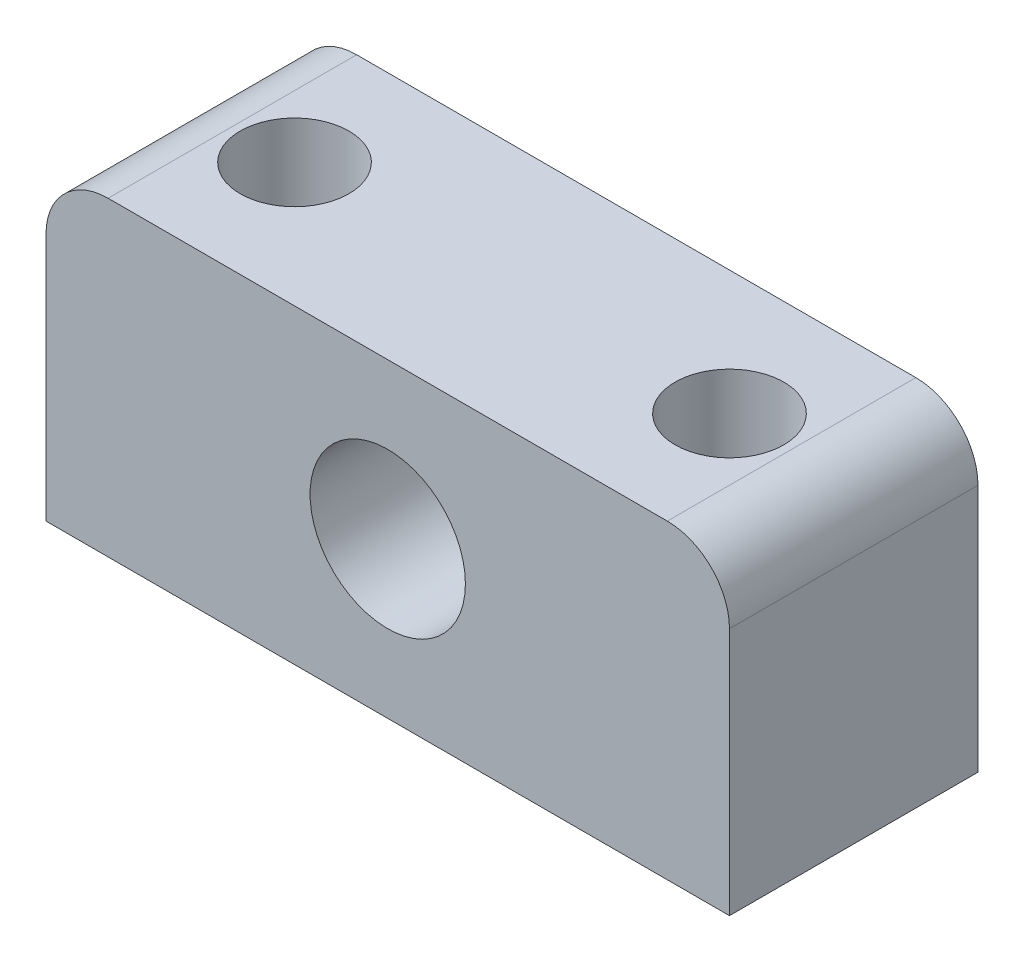
ISO-10303-21;
HEADER;
FILE_DESCRIPTION(('STEP AP214'),'2;1');
FILE_NAME('part.step','',(''),(''),'','','');
FILE_SCHEMA(('AUTOMOTIVE_DESIGN { 1 0 10303 214 1 1 1 1 }'));
ENDSEC;
DATA;
#1=APPLICATION_CONTEXT('core data for automotive mechanical design processes');
#2=APPLICATION_PROTOCOL_DEFINITION('international standard','automotive_design',2000,#1);
#3=PRODUCT_CONTEXT('',#1,'mechanical');
#4=PRODUCT('Part','Part','',(#3));
#5=PRODUCT_RELATED_PRODUCT_CATEGORY('part','',(#4));
#6=PRODUCT_DEFINITION_FORMATION('','',#4);
#7=PRODUCT_DEFINITION_CONTEXT('part definition',#1,'design');
#8=PRODUCT_DEFINITION('design','',#6,#7);
#9=PRODUCT_DEFINITION_SHAPE('','',#8);
#10=(LENGTH_UNIT() NAMED_UNIT(*) SI_UNIT(.MILLI.,.METRE.));
#11=(NAMED_UNIT(*) PLANE_ANGLE_UNIT() SI_UNIT($,.RADIAN.));
#12=(NAMED_UNIT(*) SI_UNIT($,.STERADIAN.) SOLID_ANGLE_UNIT());
#13=UNCERTAINTY_MEASURE_WITH_UNIT(LENGTH_MEASURE(1.E-05),#10,'distance_accuracy_value','');
#14=(GEOMETRIC_REPRESENTATION_CONTEXT(3) GLOBAL_UNCERTAINTY_ASSIGNED_CONTEXT((#13)) GLOBAL_UNIT_ASSIGNED_CONTEXT((#10,
#11,#12)) REPRESENTATION_CONTEXT('',''));
#15=CARTESIAN_POINT('',(0.,0.,0.));
#16=DIRECTION('',(0.,0.,1.));
#17=DIRECTION('',(1.,0.,0.));
#18=AXIS2_PLACEMENT_3D('',#15,#16,#17);
#19=CARTESIAN_POINT('',(0.,0.,4.));
#20=DIRECTION('',(0.,0.,1.));
#21=DIRECTION('',(1.,0.,0.));
#22=AXIS2_PLACEMENT_3D('',#19,#20,#21);
#23=PLANE('',#22);
#24=DIRECTION('',(0.,1.,0.));
#25=VECTOR('',#24,1.);
#26=CARTESIAN_POINT('',(11.,5.,4.));
#27=LINE('',#26,#25);
#28=CARTESIAN_POINT('',(11.,-5.,4.));
#29=VERTEX_POINT('',#28);
#30=CARTESIAN_POINT('',(11.,3.,4.));
#31=VERTEX_POINT('',#30);
#32=EDGE_CURVE('E120',#29,#31,#27,.T.);
#33=ORIENTED_EDGE('',*,*,#32,.T.);
#34=CARTESIAN_POINT('',(9.,3.,4.));
#35=DIRECTION('',(0.,0.,1.));
#36=DIRECTION('',(1.,0.,0.));
#37=AXIS2_PLACEMENT_3D('',#34,#35,#36);
#38=CIRCLE('',#37,2.);
#39=CARTESIAN_POINT('',(9.,5.,4.));
#40=VERTEX_POINT('',#39);
#41=EDGE_CURVE('E41',#31,#40,#38,.T.);
#42=ORIENTED_EDGE('',*,*,#41,.T.);
#43=DIRECTION('',(-1.,0.,0.));
#44=VECTOR('',#43,1.);
#45=CARTESIAN_POINT('',(-11.,5.,4.));
#46=LINE('',#45,#44);
#47=CARTESIAN_POINT('',(-9.,5.,4.));
#48=VERTEX_POINT('',#47);
#49=EDGE_CURVE('E94',#40,#48,#46,.T.);
#50=ORIENTED_EDGE('',*,*,#49,.T.);
#51=CARTESIAN_POINT('',(-9.,3.,4.));
#52=DIRECTION('',(0.,0.,1.));
#53=DIRECTION('',(1.,0.,0.));
#54=AXIS2_PLACEMENT_3D('',#51,#52,#53);
#55=CIRCLE('',#54,2.);
#56=CARTESIAN_POINT('',(-11.,3.,4.));
#57=VERTEX_POINT('',#56);
#58=EDGE_CURVE('E48',#48,#57,#55,.T.);
#59=ORIENTED_EDGE('',*,*,#58,.T.);
#60=DIRECTION('',(0.,-1.,0.));
#61=VECTOR('',#60,1.);
#62=CARTESIAN_POINT('',(-11.,5.,4.));
#63=LINE('',#62,#61);
#64=CARTESIAN_POINT('',(-11.,-5.,4.));
#65=VERTEX_POINT('',#64);
#66=EDGE_CURVE('E86',#57,#65,#63,.T.);
#67=ORIENTED_EDGE('',*,*,#66,.T.);
#68=DIRECTION('',(1.,0.,0.));
#69=VECTOR('',#68,1.);
#70=CARTESIAN_POINT('',(-11.,-5.,4.));
#71=LINE('',#70,#69);
#72=EDGE_CURVE('E90',#65,#29,#71,.T.);
#73=ORIENTED_EDGE('',*,*,#72,.T.);
#74=EDGE_LOOP('',(#33,#42,#50,#59,#67,#73));
#75=FACE_BOUND('',#74,.T.);
#76=CARTESIAN_POINT('',(0.,0.,4.));
#77=DIRECTION('',(0.,0.,1.));
#78=DIRECTION('',(1.,0.,0.));
#79=AXIS2_PLACEMENT_3D('',#76,#77,#78);
#80=CIRCLE('',#79,2.5);
#81=CARTESIAN_POINT('',(2.5,0.,4.));
#82=VERTEX_POINT('',#81);
#83=EDGE_CURVE('E115',#82,#82,#80,.T.);
#84=ORIENTED_EDGE('',*,*,#83,.F.);
#85=EDGE_LOOP('',(#84));
#86=FACE_BOUND('',#85,.T.);
#87=ADVANCED_FACE('F33',(#75,#86),#23,.T.);
#88=CARTESIAN_POINT('',(0.,0.,-4.));
#89=DIRECTION('',(0.,0.,1.));
#90=DIRECTION('',(1.,0.,0.));
#91=AXIS2_PLACEMENT_3D('',#88,#89,#90);
#92=PLANE('',#91);
#93=DIRECTION('',(-1.,0.,0.));
#94=VECTOR('',#93,1.);
#95=CARTESIAN_POINT('',(-11.,5.,-4.));
#96=LINE('',#95,#94);
#97=CARTESIAN_POINT('',(9.,5.,-4.));
#98=VERTEX_POINT('',#97);
#99=CARTESIAN_POINT('',(-9.,5.,-4.));
#100=VERTEX_POINT('',#99);
#101=EDGE_CURVE('E114',#98,#100,#96,.T.);
#102=ORIENTED_EDGE('',*,*,#101,.F.);
#103=CARTESIAN_POINT('',(9.,3.,-4.));
#104=DIRECTION('',(0.,0.,1.));
#105=DIRECTION('',(1.,0.,0.));
#106=AXIS2_PLACEMENT_3D('',#103,#104,#105);
#107=CIRCLE('',#106,2.);
#108=CARTESIAN_POINT('',(11.,3.,-4.));
#109=VERTEX_POINT('',#108);
#110=EDGE_CURVE('E128',#98,#109,#107,.F.);
#111=ORIENTED_EDGE('',*,*,#110,.T.);
#112=DIRECTION('',(0.,1.,0.));
#113=VECTOR('',#112,1.);
#114=CARTESIAN_POINT('',(11.,5.,-4.));
#115=LINE('',#114,#113);
#116=CARTESIAN_POINT('',(11.,-5.,-4.));
#117=VERTEX_POINT('',#116);
#118=EDGE_CURVE('E112',#117,#109,#115,.T.);
#119=ORIENTED_EDGE('',*,*,#118,.F.);
#120=DIRECTION('',(1.,0.,0.));
#121=VECTOR('',#120,1.);
#122=CARTESIAN_POINT('',(-11.,-5.,-4.));
#123=LINE('',#122,#121);
#124=CARTESIAN_POINT('',(-11.,-5.,-4.));
#125=VERTEX_POINT('',#124);
#126=EDGE_CURVE('E119',#125,#117,#123,.T.);
#127=ORIENTED_EDGE('',*,*,#126,.F.);
#128=DIRECTION('',(0.,-1.,0.));
#129=VECTOR('',#128,1.);
#130=CARTESIAN_POINT('',(-11.,5.,-4.));
#131=LINE('',#130,#129);
#132=CARTESIAN_POINT('',(-11.,3.,-4.));
#133=VERTEX_POINT('',#132);
#134=EDGE_CURVE('E100',#133,#125,#131,.T.);
#135=ORIENTED_EDGE('',*,*,#134,.F.);
#136=CARTESIAN_POINT('',(-9.,3.,-4.));
#137=DIRECTION('',(0.,0.,1.));
#138=DIRECTION('',(1.,0.,0.));
#139=AXIS2_PLACEMENT_3D('',#136,#137,#138);
#140=CIRCLE('',#139,2.);
#141=EDGE_CURVE('E126',#133,#100,#140,.F.);
#142=ORIENTED_EDGE('',*,*,#141,.T.);
#143=EDGE_LOOP('',(#102,#111,#119,#127,#135,#142));
#144=FACE_BOUND('',#143,.T.);
#145=CARTESIAN_POINT('',(0.,0.,-4.));
#146=DIRECTION('',(0.,0.,1.));
#147=DIRECTION('',(1.,0.,0.));
#148=AXIS2_PLACEMENT_3D('',#145,#146,#147);
#149=CIRCLE('',#148,2.5);
#150=CARTESIAN_POINT('',(2.5,0.,-4.));
#151=VERTEX_POINT('',#150);
#152=EDGE_CURVE('E147',#151,#151,#149,.T.);
#153=ORIENTED_EDGE('',*,*,#152,.T.);
#154=EDGE_LOOP('',(#153));
#155=FACE_BOUND('',#154,.T.);
#156=ADVANCED_FACE('F142',(#144,#155),#92,.F.);
#157=CARTESIAN_POINT('',(11.,5.,4.));
#158=DIRECTION('',(-1.,0.,0.));
#159=DIRECTION('',(0.,0.,1.));
#160=AXIS2_PLACEMENT_3D('',#157,#158,#159);
#161=PLANE('',#160);
#162=ORIENTED_EDGE('',*,*,#118,.T.);
#163=DIRECTION('',(0.,0.,-1.));
#164=VECTOR('',#163,1.);
#165=CARTESIAN_POINT('',(11.,3.,4.));
#166=LINE('',#165,#164);
#167=EDGE_CURVE('E56',#109,#31,#166,.F.);
#168=ORIENTED_EDGE('',*,*,#167,.T.);
#169=ORIENTED_EDGE('',*,*,#32,.F.);
#170=DIRECTION('',(0.,0.,-1.));
#171=VECTOR('',#170,1.);
#172=CARTESIAN_POINT('',(11.,-5.,4.));
#173=LINE('',#172,#171);
#174=EDGE_CURVE('E104',#29,#117,#173,.T.);
#175=ORIENTED_EDGE('',*,*,#174,.T.);
#176=EDGE_LOOP('',(#162,#168,#169,#175));
#177=FACE_BOUND('',#176,.T.);
#178=ADVANCED_FACE('F144',(#177),#161,.F.);
#179=CARTESIAN_POINT('',(-11.,5.,4.));
#180=DIRECTION('',(0.,-1.,0.));
#181=DIRECTION('',(0.,0.,-1.));
#182=AXIS2_PLACEMENT_3D('',#179,#180,#181);
#183=PLANE('',#182);
#184=CARTESIAN_POINT('',(7.,5.,0.));
#185=DIRECTION('',(0.,1.,0.));
#186=DIRECTION('',(0.,0.,1.));
#187=AXIS2_PLACEMENT_3D('',#184,#185,#186);
#188=CIRCLE('',#187,1.75);
#189=CARTESIAN_POINT('',(7.,5.,1.75));
#190=VERTEX_POINT('',#189);
#191=EDGE_CURVE('E159',#190,#190,#188,.T.);
#192=ORIENTED_EDGE('',*,*,#191,.F.);
#193=EDGE_LOOP('',(#192));
#194=FACE_BOUND('',#193,.T.);
#195=CARTESIAN_POINT('',(-7.,5.,0.));
#196=DIRECTION('',(0.,1.,0.));
#197=DIRECTION('',(0.,0.,-1.));
#198=AXIS2_PLACEMENT_3D('',#195,#196,#197);
#199=CIRCLE('',#198,1.75);
#200=CARTESIAN_POINT('',(-7.,5.,-1.75));
#201=VERTEX_POINT('',#200);
#202=EDGE_CURVE('E153',#201,#201,#199,.T.);
#203=ORIENTED_EDGE('',*,*,#202,.F.);
#204=EDGE_LOOP('',(#203));
#205=FACE_BOUND('',#204,.T.);
#206=ORIENTED_EDGE('',*,*,#49,.F.);
#207=DIRECTION('',(0.,0.,-1.));
#208=VECTOR('',#207,1.);
#209=CARTESIAN_POINT('',(9.,5.,4.));
#210=LINE('',#209,#208);
#211=EDGE_CURVE('E123',#40,#98,#210,.T.);
#212=ORIENTED_EDGE('',*,*,#211,.T.);
#213=ORIENTED_EDGE('',*,*,#101,.T.);
#214=DIRECTION('',(0.,0.,-1.));
#215=VECTOR('',#214,1.);
#216=CARTESIAN_POINT('',(-9.,5.,4.));
#217=LINE('',#216,#215);
#218=EDGE_CURVE('E103',#100,#48,#217,.F.);
#219=ORIENTED_EDGE('',*,*,#218,.T.);
#220=EDGE_LOOP('',(#206,#212,#213,#219));
#221=FACE_BOUND('',#220,.T.);
#222=ADVANCED_FACE('F136',(#194,#205,#221),#183,.F.);
#223=CARTESIAN_POINT('',(-11.,5.,4.));
#224=DIRECTION('',(1.,0.,0.));
#225=DIRECTION('',(0.,0.,-1.));
#226=AXIS2_PLACEMENT_3D('',#223,#224,#225);
#227=PLANE('',#226);
#228=ORIENTED_EDGE('',*,*,#66,.F.);
#229=DIRECTION('',(0.,0.,-1.));
#230=VECTOR('',#229,1.);
#231=CARTESIAN_POINT('',(-11.,3.,4.));
#232=LINE('',#231,#230);
#233=EDGE_CURVE('E11',#57,#133,#232,.T.);
#234=ORIENTED_EDGE('',*,*,#233,.T.);
#235=ORIENTED_EDGE('',*,*,#134,.T.);
#236=DIRECTION('',(0.,0.,-1.));
#237=VECTOR('',#236,1.);
#238=CARTESIAN_POINT('',(-11.,-5.,4.));
#239=LINE('',#238,#237);
#240=EDGE_CURVE('E97',#65,#125,#239,.T.);
#241=ORIENTED_EDGE('',*,*,#240,.F.);
#242=EDGE_LOOP('',(#228,#234,#235,#241));
#243=FACE_BOUND('',#242,.T.);
#244=ADVANCED_FACE('F98',(#243),#227,.F.);
#245=CARTESIAN_POINT('',(-11.,-5.,4.));
#246=DIRECTION('',(0.,1.,0.));
#247=DIRECTION('',(0.,0.,1.));
#248=AXIS2_PLACEMENT_3D('',#245,#246,#247);
#249=PLANE('',#248);
#250=CARTESIAN_POINT('',(7.,-5.,0.));
#251=DIRECTION('',(0.,1.,0.));
#252=DIRECTION('',(0.,0.,1.));
#253=AXIS2_PLACEMENT_3D('',#250,#251,#252);
#254=CIRCLE('',#253,1.75);
#255=CARTESIAN_POINT('',(7.,-5.,1.75));
#256=VERTEX_POINT('',#255);
#257=EDGE_CURVE('E150',#256,#256,#254,.T.);
#258=ORIENTED_EDGE('',*,*,#257,.T.);
#259=EDGE_LOOP('',(#258));
#260=FACE_BOUND('',#259,.T.);
#261=CARTESIAN_POINT('',(-7.,-5.,0.));
#262=DIRECTION('',(0.,1.,0.));
#263=DIRECTION('',(0.,0.,-1.));
#264=AXIS2_PLACEMENT_3D('',#261,#262,#263);
#265=CIRCLE('',#264,1.75);
#266=CARTESIAN_POINT('',(-7.,-5.,-1.75));
#267=VERTEX_POINT('',#266);
#268=EDGE_CURVE('E156',#267,#267,#265,.T.);
#269=ORIENTED_EDGE('',*,*,#268,.T.);
#270=EDGE_LOOP('',(#269));
#271=FACE_BOUND('',#270,.T.);
#272=ORIENTED_EDGE('',*,*,#126,.T.);
#273=ORIENTED_EDGE('',*,*,#174,.F.);
#274=ORIENTED_EDGE('',*,*,#72,.F.);
#275=ORIENTED_EDGE('',*,*,#240,.T.);
#276=EDGE_LOOP('',(#272,#273,#274,#275));
#277=FACE_BOUND('',#276,.T.);
#278=ADVANCED_FACE('F106',(#260,#271,#277),#249,.F.);
#279=CARTESIAN_POINT('',(0.,0.,4.));
#280=DIRECTION('',(0.,0.,-1.));
#281=DIRECTION('',(-1.,0.,0.));
#282=AXIS2_PLACEMENT_3D('',#279,#280,#281);
#283=CYLINDRICAL_SURFACE('',#282,2.5);
#284=ORIENTED_EDGE('',*,*,#83,.T.);
#285=EDGE_LOOP('',(#284));
#286=FACE_BOUND('',#285,.T.);
#287=ORIENTED_EDGE('',*,*,#152,.F.);
#288=EDGE_LOOP('',(#287));
#289=FACE_BOUND('',#288,.T.);
#290=ADVANCED_FACE('F180',(#286,#289),#283,.F.);
#291=CARTESIAN_POINT('',(-7.,-5.,0.));
#292=DIRECTION('',(0.,1.,0.));
#293=DIRECTION('',(0.,0.,1.));
#294=AXIS2_PLACEMENT_3D('',#291,#292,#293);
#295=CYLINDRICAL_SURFACE('',#294,1.75);
#296=ORIENTED_EDGE('',*,*,#268,.F.);
#297=EDGE_LOOP('',(#296));
#298=FACE_BOUND('',#297,.T.);
#299=ORIENTED_EDGE('',*,*,#202,.T.);
#300=EDGE_LOOP('',(#299));
#301=FACE_BOUND('',#300,.T.);
#302=ADVANCED_FACE('F170',(#298,#301),#295,.F.);
#303=CARTESIAN_POINT('',(7.,-5.,0.));
#304=DIRECTION('',(0.,1.,0.));
#305=DIRECTION('',(0.,0.,1.));
#306=AXIS2_PLACEMENT_3D('',#303,#304,#305);
#307=CYLINDRICAL_SURFACE('',#306,1.75);
#308=ORIENTED_EDGE('',*,*,#257,.F.);
#309=EDGE_LOOP('',(#308));
#310=FACE_BOUND('',#309,.T.);
#311=ORIENTED_EDGE('',*,*,#191,.T.);
#312=EDGE_LOOP('',(#311));
#313=FACE_BOUND('',#312,.T.);
#314=ADVANCED_FACE('F167',(#310,#313),#307,.F.);
#315=CARTESIAN_POINT('',(9.,3.,4.));
#316=DIRECTION('',(0.,0.,-1.));
#317=DIRECTION('',(-1.,0.,0.));
#318=AXIS2_PLACEMENT_3D('',#315,#316,#317);
#319=CYLINDRICAL_SURFACE('',#318,2.);
#320=ORIENTED_EDGE('',*,*,#41,.F.);
#321=ORIENTED_EDGE('',*,*,#167,.F.);
#322=ORIENTED_EDGE('',*,*,#110,.F.);
#323=ORIENTED_EDGE('',*,*,#211,.F.);
#324=EDGE_LOOP('',(#320,#321,#322,#323));
#325=FACE_BOUND('',#324,.T.);
#326=ADVANCED_FACE('F139',(#325),#319,.T.);
#327=CARTESIAN_POINT('',(-9.,3.,4.));
#328=DIRECTION('',(0.,0.,-1.));
#329=DIRECTION('',(-1.,0.,0.));
#330=AXIS2_PLACEMENT_3D('',#327,#328,#329);
#331=CYLINDRICAL_SURFACE('',#330,2.);
#332=ORIENTED_EDGE('',*,*,#58,.F.);
#333=ORIENTED_EDGE('',*,*,#218,.F.);
#334=ORIENTED_EDGE('',*,*,#141,.F.);
#335=ORIENTED_EDGE('',*,*,#233,.F.);
#336=EDGE_LOOP('',(#332,#333,#334,#335));
#337=FACE_BOUND('',#336,.T.);
#338=ADVANCED_FACE('F35',(#337),#331,.T.);
#339=CLOSED_SHELL('',(#87,#156,#178,#222,#244,#278,#290,#302,#314,#326,#338));
#340=MANIFOLD_SOLID_BREP('B2',#339);
#341=ADVANCED_BREP_SHAPE_REPRESENTATION('',(#18,#340),#14);
#342=SHAPE_DEFINITION_REPRESENTATION(#9,#341);
ENDSEC;
END-ISO-10303-21;
